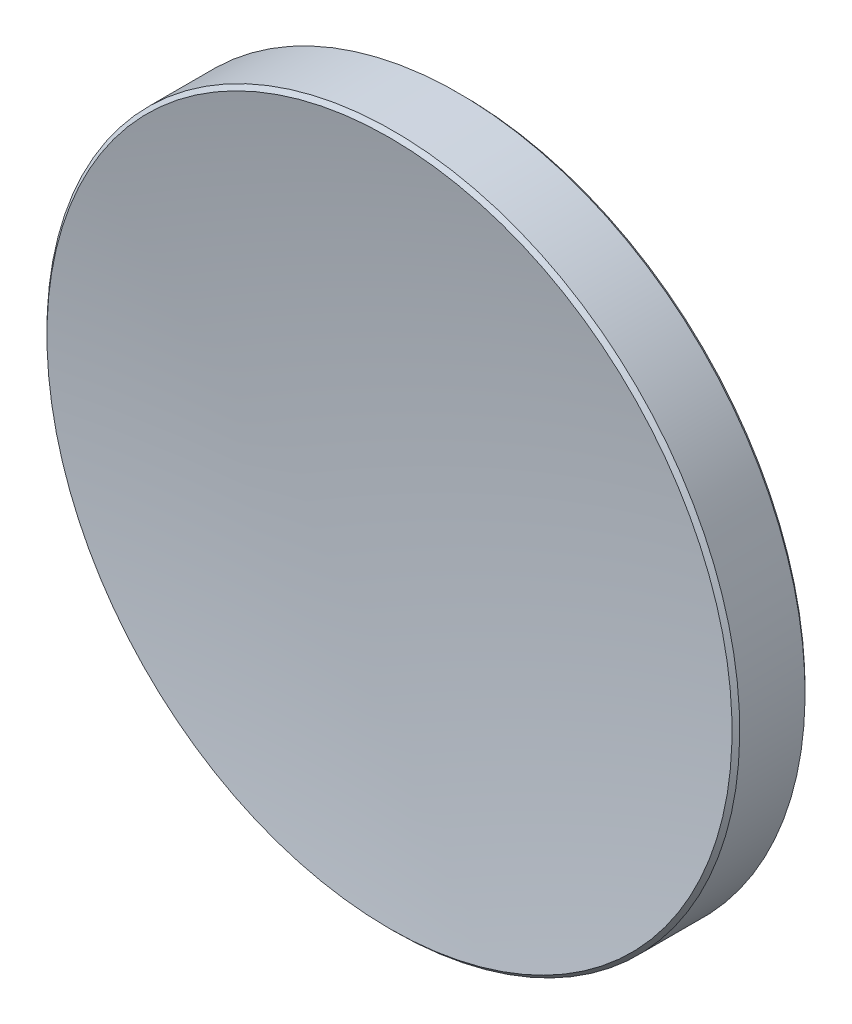
ISO-10303-21;
HEADER;
FILE_DESCRIPTION(('STEP AP214'),'2;1');
FILE_NAME('part.step','',(''),(''),'','','');
FILE_SCHEMA(('AUTOMOTIVE_DESIGN { 1 0 10303 214 1 1 1 1 }'));
ENDSEC;
DATA;
#1=APPLICATION_CONTEXT('core data for automotive mechanical design processes');
#2=APPLICATION_PROTOCOL_DEFINITION('international standard','automotive_design',2000,#1);
#3=PRODUCT_CONTEXT('',#1,'mechanical');
#4=PRODUCT('Part','Part','',(#3));
#5=PRODUCT_RELATED_PRODUCT_CATEGORY('part','',(#4));
#6=PRODUCT_DEFINITION_FORMATION('','',#4);
#7=PRODUCT_DEFINITION_CONTEXT('part definition',#1,'design');
#8=PRODUCT_DEFINITION('design','',#6,#7);
#9=PRODUCT_DEFINITION_SHAPE('','',#8);
#10=(LENGTH_UNIT() NAMED_UNIT(*) SI_UNIT(.MILLI.,.METRE.));
#11=(NAMED_UNIT(*) PLANE_ANGLE_UNIT() SI_UNIT($,.RADIAN.));
#12=(NAMED_UNIT(*) SI_UNIT($,.STERADIAN.) SOLID_ANGLE_UNIT());
#13=UNCERTAINTY_MEASURE_WITH_UNIT(LENGTH_MEASURE(1.E-05),#10,'distance_accuracy_value','');
#14=(GEOMETRIC_REPRESENTATION_CONTEXT(3) GLOBAL_UNCERTAINTY_ASSIGNED_CONTEXT((#13)) GLOBAL_UNIT_ASSIGNED_CONTEXT((#10,
#11,#12)) REPRESENTATION_CONTEXT('',''));
#15=CARTESIAN_POINT('',(0.,0.,0.));
#16=DIRECTION('',(0.,0.,1.));
#17=DIRECTION('',(1.,0.,0.));
#18=AXIS2_PLACEMENT_3D('',#15,#16,#17);
#19=CARTESIAN_POINT('',(0.,0.,80.103731452388));
#20=DIRECTION('',(0.,0.,1.));
#21=DIRECTION('',(0.,1.,0.));
#22=AXIS2_PLACEMENT_3D('',#19,#20,#21);
#23=SPHERICAL_SURFACE('',#22,78.62);
#24=CARTESIAN_POINT('',(0.,0.,2.49325211841904));
#25=DIRECTION('',(0.,0.,1.));
#26=DIRECTION('',(0.,-1.,0.));
#27=AXIS2_PLACEMENT_3D('',#24,#25,#26);
#28=CIRCLE('',#27,12.5585786437627);
#29=CARTESIAN_POINT('',(0.,-12.5585786437627,2.49325211841904));
#30=VERTEX_POINT('',#29);
#31=EDGE_CURVE('E27',#30,#30,#28,.T.);
#32=ORIENTED_EDGE('',*,*,#31,.T.);
#33=EDGE_LOOP('',(#32));
#34=FACE_BOUND('',#33,.T.);
#35=ADVANCED_FACE('F13',(#34),#23,.F.);
#36=CARTESIAN_POINT('',(0.,0.,32.483731452388));
#37=DIRECTION('',(0.,0.,1.));
#38=DIRECTION('',(0.,-1.,0.));
#39=AXIS2_PLACEMENT_3D('',#36,#37,#38);
#40=SPHERICAL_SURFACE('',#39,35.);
#41=CARTESIAN_POINT('',(0.,0.,-0.185552323789675));
#42=DIRECTION('',(0.,0.,1.));
#43=DIRECTION('',(0.,-1.,0.));
#44=AXIS2_PLACEMENT_3D('',#41,#42,#43);
#45=CIRCLE('',#44,12.5585786437627);
#46=CARTESIAN_POINT('',(0.,-12.5585786437627,-0.185552323789677));
#47=VERTEX_POINT('',#46);
#48=EDGE_CURVE('E9',#47,#47,#45,.T.);
#49=ORIENTED_EDGE('',*,*,#48,.F.);
#50=EDGE_LOOP('',(#49));
#51=FACE_BOUND('',#50,.T.);
#52=ADVANCED_FACE('F48',(#51),#40,.T.);
#53=CARTESIAN_POINT('',(0.,0.,-0.185552323789675));
#54=DIRECTION('',(0.,0.,1.));
#55=DIRECTION('',(0.,-1.,0.));
#56=AXIS2_PLACEMENT_3D('',#53,#54,#55);
#57=CONICAL_SURFACE('',#56,12.5585786437627,0.785398163397459);
#58=CARTESIAN_POINT('',(0.,0.,-0.0441309675523649));
#59=DIRECTION('',(0.,0.,1.));
#60=DIRECTION('',(0.,-1.,0.));
#61=AXIS2_PLACEMENT_3D('',#58,#59,#60);
#62=CIRCLE('',#61,12.7);
#63=CARTESIAN_POINT('',(0.,-12.7,-0.0441309675523672));
#64=VERTEX_POINT('',#63);
#65=EDGE_CURVE('E19',#64,#64,#62,.T.);
#66=ORIENTED_EDGE('',*,*,#65,.F.);
#67=EDGE_LOOP('',(#66));
#68=FACE_BOUND('',#67,.T.);
#69=ORIENTED_EDGE('',*,*,#48,.T.);
#70=EDGE_LOOP('',(#69));
#71=FACE_BOUND('',#70,.T.);
#72=ADVANCED_FACE('F42',(#68,#71),#57,.T.);
#73=CARTESIAN_POINT('',(0.,0.,1.48373145238803));
#74=DIRECTION('',(0.,0.,1.));
#75=DIRECTION('',(0.,-1.,0.));
#76=AXIS2_PLACEMENT_3D('',#73,#74,#75);
#77=CYLINDRICAL_SURFACE('',#76,12.7);
#78=CARTESIAN_POINT('',(0.,0.,2.35183076218173));
#79=DIRECTION('',(0.,0.,1.));
#80=DIRECTION('',(0.,-1.,0.));
#81=AXIS2_PLACEMENT_3D('',#78,#79,#80);
#82=CIRCLE('',#81,12.7);
#83=CARTESIAN_POINT('',(0.,-12.7,2.35183076218173));
#84=VERTEX_POINT('',#83);
#85=EDGE_CURVE('E23',#84,#84,#82,.T.);
#86=ORIENTED_EDGE('',*,*,#85,.F.);
#87=EDGE_LOOP('',(#86));
#88=FACE_BOUND('',#87,.T.);
#89=ORIENTED_EDGE('',*,*,#65,.T.);
#90=EDGE_LOOP('',(#89));
#91=FACE_BOUND('',#90,.T.);
#92=ADVANCED_FACE('F37',(#88,#91),#77,.T.);
#93=CARTESIAN_POINT('',(0.,0.,2.35183076218173));
#94=DIRECTION('',(0.,0.,-1.));
#95=DIRECTION('',(0.,1.,0.));
#96=AXIS2_PLACEMENT_3D('',#93,#94,#95);
#97=CONICAL_SURFACE('',#96,12.7,0.785398163397461);
#98=ORIENTED_EDGE('',*,*,#31,.F.);
#99=EDGE_LOOP('',(#98));
#100=FACE_BOUND('',#99,.T.);
#101=ORIENTED_EDGE('',*,*,#85,.T.);
#102=EDGE_LOOP('',(#101));
#103=FACE_BOUND('',#102,.T.);
#104=ADVANCED_FACE('F34',(#100,#103),#97,.T.);
#105=CLOSED_SHELL('',(#35,#52,#72,#92,#104));
#106=MANIFOLD_SOLID_BREP('B1',#105);
#107=ADVANCED_BREP_SHAPE_REPRESENTATION('',(#18,#106),#14);
#108=SHAPE_DEFINITION_REPRESENTATION(#9,#107);
ENDSEC;
END-ISO-10303-21;
